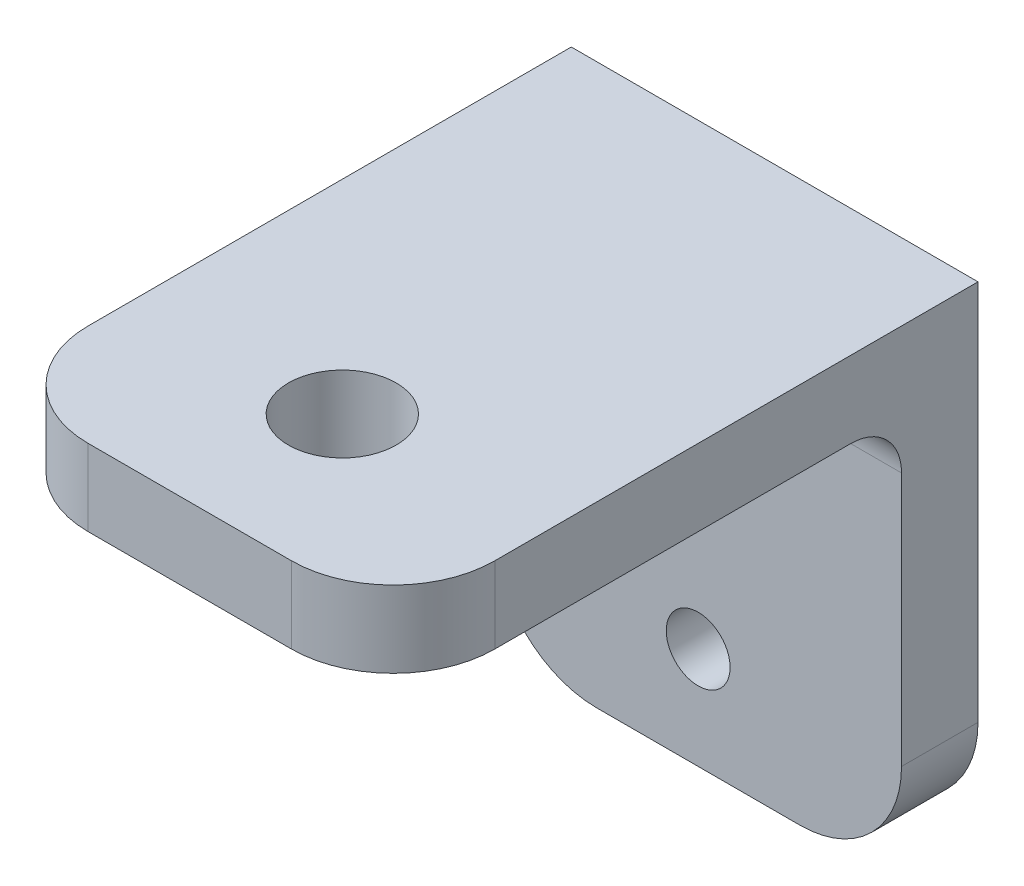
ISO-10303-21;
HEADER;
FILE_DESCRIPTION(('STEP AP214'),'2;1');
FILE_NAME('part.step','',(''),(''),'','','');
FILE_SCHEMA(('AUTOMOTIVE_DESIGN { 1 0 10303 214 1 1 1 1 }'));
ENDSEC;
DATA;
#1=APPLICATION_CONTEXT('core data for automotive mechanical design processes');
#2=APPLICATION_PROTOCOL_DEFINITION('international standard','automotive_design',2000,#1);
#3=PRODUCT_CONTEXT('',#1,'mechanical');
#4=PRODUCT('Part','Part','',(#3));
#5=PRODUCT_RELATED_PRODUCT_CATEGORY('part','',(#4));
#6=PRODUCT_DEFINITION_FORMATION('','',#4);
#7=PRODUCT_DEFINITION_CONTEXT('part definition',#1,'design');
#8=PRODUCT_DEFINITION('design','',#6,#7);
#9=PRODUCT_DEFINITION_SHAPE('','',#8);
#10=(LENGTH_UNIT() NAMED_UNIT(*) SI_UNIT(.MILLI.,.METRE.));
#11=(NAMED_UNIT(*) PLANE_ANGLE_UNIT() SI_UNIT($,.RADIAN.));
#12=(NAMED_UNIT(*) SI_UNIT($,.STERADIAN.) SOLID_ANGLE_UNIT());
#13=UNCERTAINTY_MEASURE_WITH_UNIT(LENGTH_MEASURE(1.E-05),#10,'distance_accuracy_value','');
#14=(GEOMETRIC_REPRESENTATION_CONTEXT(3) GLOBAL_UNCERTAINTY_ASSIGNED_CONTEXT((#13)) GLOBAL_UNIT_ASSIGNED_CONTEXT((#10,
#11,#12)) REPRESENTATION_CONTEXT('',''));
#15=CARTESIAN_POINT('',(0.,0.,0.));
#16=DIRECTION('',(0.,0.,1.));
#17=DIRECTION('',(1.,0.,0.));
#18=AXIS2_PLACEMENT_3D('',#15,#16,#17);
#19=CARTESIAN_POINT('',(0.,25.989203219563,79.0985735246069));
#20=DIRECTION('',(1.,0.,0.));
#21=DIRECTION('',(0.,1.,0.));
#22=AXIS2_PLACEMENT_3D('',#19,#20,#21);
#23=PLANE('',#22);
#24=DIRECTION('',(0.,0.,-1.));
#25=VECTOR('',#24,1.);
#26=CARTESIAN_POINT('',(0.,17.2516032195629,72.3548735246069));
#27=LINE('',#26,#25);
#28=CARTESIAN_POINT('',(0.,17.2516032195629,65.6111735246069));
#29=VERTEX_POINT('',#28);
#30=CARTESIAN_POINT('',(0.,17.2516032195629,60.8359735246069));
#31=VERTEX_POINT('',#30);
#32=EDGE_CURVE('E153',#29,#31,#27,.T.);
#33=ORIENTED_EDGE('',*,*,#32,.F.);
#34=DIRECTION('',(0.,-1.,0.));
#35=VECTOR('',#34,1.);
#36=CARTESIAN_POINT('',(0.,36.301603219563,65.6111735246069));
#37=LINE('',#36,#35);
#38=CARTESIAN_POINT('',(0.,33.126603219563,65.6111735246069));
#39=VERTEX_POINT('',#38);
#40=EDGE_CURVE('E271',#39,#29,#37,.T.);
#41=ORIENTED_EDGE('',*,*,#40,.F.);
#42=CARTESIAN_POINT('',(0.,33.126603219563,68.7861735246069));
#43=DIRECTION('',(-1.,0.,0.));
#44=DIRECTION('',(0.,0.707106781186546,-0.707106781186549));
#45=AXIS2_PLACEMENT_3D('',#42,#43,#44);
#46=CIRCLE('',#45,3.175);
#47=CARTESIAN_POINT('',(0.,36.301603219563,68.7861735246069));
#48=VERTEX_POINT('',#47);
#49=EDGE_CURVE('E260',#48,#39,#46,.T.);
#50=ORIENTED_EDGE('',*,*,#49,.F.);
#51=DIRECTION('',(0.,0.,-1.));
#52=VECTOR('',#51,1.);
#53=CARTESIAN_POINT('',(0.,36.301603219563,97.3611735246069));
#54=LINE('',#53,#52);
#55=CARTESIAN_POINT('',(0.,36.301603219563,91.0111735246069));
#56=VERTEX_POINT('',#55);
#57=EDGE_CURVE('E191',#56,#48,#54,.T.);
#58=ORIENTED_EDGE('',*,*,#57,.F.);
#59=DIRECTION('',(0.,-1.,0.));
#60=VECTOR('',#59,1.);
#61=CARTESIAN_POINT('',(0.,33.533003219563,91.0111735246069));
#62=LINE('',#61,#60);
#63=CARTESIAN_POINT('',(0.,41.076803219563,91.0111735246069));
#64=VERTEX_POINT('',#63);
#65=EDGE_CURVE('E257',#64,#56,#62,.T.);
#66=ORIENTED_EDGE('',*,*,#65,.F.);
#67=DIRECTION('',(0.,0.,1.));
#68=VECTOR('',#67,1.);
#69=CARTESIAN_POINT('',(0.,41.076803219563,60.8359735246069));
#70=LINE('',#69,#68);
#71=CARTESIAN_POINT('',(0.,41.076803219563,60.8359735246069));
#72=VERTEX_POINT('',#71);
#73=EDGE_CURVE('E11',#72,#64,#70,.T.);
#74=ORIENTED_EDGE('',*,*,#73,.F.);
#75=DIRECTION('',(0.,1.,0.));
#76=VECTOR('',#75,1.);
#77=CARTESIAN_POINT('',(0.,10.9016032195629,60.8359735246069));
#78=LINE('',#77,#76);
#79=EDGE_CURVE('E166',#31,#72,#78,.T.);
#80=ORIENTED_EDGE('',*,*,#79,.F.);
#81=EDGE_LOOP('',(#33,#41,#50,#58,#66,#74,#80));
#82=FACE_BOUND('',#81,.T.);
#83=ADVANCED_FACE('F17',(#82),#23,.F.);
#84=CARTESIAN_POINT('',(25.4,25.989203219563,79.0985735246069));
#85=DIRECTION('',(1.,0.,0.));
#86=DIRECTION('',(0.,1.,0.));
#87=AXIS2_PLACEMENT_3D('',#84,#85,#86);
#88=PLANE('',#87);
#89=DIRECTION('',(0.,0.,1.));
#90=VECTOR('',#89,1.);
#91=CARTESIAN_POINT('',(25.4,17.2516032195629,72.3548735246069));
#92=LINE('',#91,#90);
#93=CARTESIAN_POINT('',(25.4,17.2516032195629,60.8359735246069));
#94=VERTEX_POINT('',#93);
#95=CARTESIAN_POINT('',(25.4,17.2516032195629,65.6111735246069));
#96=VERTEX_POINT('',#95);
#97=EDGE_CURVE('E302',#94,#96,#92,.T.);
#98=ORIENTED_EDGE('',*,*,#97,.F.);
#99=DIRECTION('',(0.,1.,0.));
#100=VECTOR('',#99,1.);
#101=CARTESIAN_POINT('',(25.4,10.9016032195629,60.8359735246069));
#102=LINE('',#101,#100);
#103=CARTESIAN_POINT('',(25.4,41.076803219563,60.8359735246069));
#104=VERTEX_POINT('',#103);
#105=EDGE_CURVE('E198',#94,#104,#102,.T.);
#106=ORIENTED_EDGE('',*,*,#105,.T.);
#107=DIRECTION('',(0.,0.,1.));
#108=VECTOR('',#107,1.);
#109=CARTESIAN_POINT('',(25.4,41.076803219563,60.8359735246069));
#110=LINE('',#109,#108);
#111=CARTESIAN_POINT('',(25.4,41.076803219563,91.0111735246069));
#112=VERTEX_POINT('',#111);
#113=EDGE_CURVE('E26',#104,#112,#110,.T.);
#114=ORIENTED_EDGE('',*,*,#113,.T.);
#115=DIRECTION('',(0.,1.,0.));
#116=VECTOR('',#115,1.);
#117=CARTESIAN_POINT('',(25.4,33.533003219563,91.0111735246069));
#118=LINE('',#117,#116);
#119=CARTESIAN_POINT('',(25.4,36.301603219563,91.0111735246069));
#120=VERTEX_POINT('',#119);
#121=EDGE_CURVE('E213',#120,#112,#118,.T.);
#122=ORIENTED_EDGE('',*,*,#121,.F.);
#123=DIRECTION('',(0.,0.,-1.));
#124=VECTOR('',#123,1.);
#125=CARTESIAN_POINT('',(25.4,36.301603219563,97.3611735246069));
#126=LINE('',#125,#124);
#127=CARTESIAN_POINT('',(25.4,36.301603219563,68.7861735246069));
#128=VERTEX_POINT('',#127);
#129=EDGE_CURVE('E238',#120,#128,#126,.T.);
#130=ORIENTED_EDGE('',*,*,#129,.T.);
#131=CARTESIAN_POINT('',(25.4,33.126603219563,68.7861735246069));
#132=DIRECTION('',(1.,0.,0.));
#133=DIRECTION('',(0.,0.707106781186546,-0.707106781186549));
#134=AXIS2_PLACEMENT_3D('',#131,#132,#133);
#135=CIRCLE('',#134,3.175);
#136=CARTESIAN_POINT('',(25.4,33.126603219563,65.6111735246069));
#137=VERTEX_POINT('',#136);
#138=EDGE_CURVE('E265',#137,#128,#135,.T.);
#139=ORIENTED_EDGE('',*,*,#138,.F.);
#140=DIRECTION('',(0.,-1.,0.));
#141=VECTOR('',#140,1.);
#142=CARTESIAN_POINT('',(25.4,36.301603219563,65.6111735246069));
#143=LINE('',#142,#141);
#144=EDGE_CURVE('E268',#137,#96,#143,.T.);
#145=ORIENTED_EDGE('',*,*,#144,.T.);
#146=EDGE_LOOP('',(#98,#106,#114,#122,#130,#139,#145));
#147=FACE_BOUND('',#146,.T.);
#148=ADVANCED_FACE('F337',(#147),#88,.T.);
#149=CARTESIAN_POINT('',(0.,41.076803219563,60.8359735246069));
#150=DIRECTION('',(0.,1.,0.));
#151=DIRECTION('',(0.,0.,-1.));
#152=AXIS2_PLACEMENT_3D('',#149,#150,#151);
#153=PLANE('',#152);
#154=CARTESIAN_POINT('',(12.7,41.076803219563,87.8361735246069));
#155=DIRECTION('',(0.,-1.,0.));
#156=DIRECTION('',(1.,0.,0.));
#157=AXIS2_PLACEMENT_3D('',#154,#155,#156);
#158=CIRCLE('',#157,3.3655);
#159=CARTESIAN_POINT('',(9.3345,41.076803219563,87.8361735246069));
#160=VERTEX_POINT('',#159);
#161=EDGE_CURVE('E36',#160,#160,#158,.T.);
#162=ORIENTED_EDGE('',*,*,#161,.T.);
#163=EDGE_LOOP('',(#162));
#164=FACE_BOUND('',#163,.T.);
#165=CARTESIAN_POINT('',(19.05,41.076803219563,91.0111735246069));
#166=DIRECTION('',(0.,-1.,0.));
#167=DIRECTION('',(0.707106781186547,0.,0.707106781186548));
#168=AXIS2_PLACEMENT_3D('',#165,#166,#167);
#169=CIRCLE('',#168,6.35);
#170=CARTESIAN_POINT('',(19.05,41.076803219563,97.3611735246069));
#171=VERTEX_POINT('',#170);
#172=EDGE_CURVE('E217',#112,#171,#169,.T.);
#173=ORIENTED_EDGE('',*,*,#172,.F.);
#174=ORIENTED_EDGE('',*,*,#113,.F.);
#175=DIRECTION('',(1.,0.,0.));
#176=VECTOR('',#175,1.);
#177=CARTESIAN_POINT('',(0.,41.076803219563,60.8359735246069));
#178=LINE('',#177,#176);
#179=EDGE_CURVE('E172',#72,#104,#178,.T.);
#180=ORIENTED_EDGE('',*,*,#179,.F.);
#181=ORIENTED_EDGE('',*,*,#73,.T.);
#182=CARTESIAN_POINT('',(6.35,41.076803219563,91.0111735246069));
#183=DIRECTION('',(0.,-1.,0.));
#184=DIRECTION('',(-0.707106781186547,0.,0.707106781186548));
#185=AXIS2_PLACEMENT_3D('',#182,#183,#184);
#186=CIRCLE('',#185,6.35);
#187=CARTESIAN_POINT('',(6.35,41.076803219563,97.3611735246069));
#188=VERTEX_POINT('',#187);
#189=EDGE_CURVE('E253',#188,#64,#186,.T.);
#190=ORIENTED_EDGE('',*,*,#189,.F.);
#191=DIRECTION('',(1.,0.,0.));
#192=VECTOR('',#191,1.);
#193=CARTESIAN_POINT('',(0.,41.076803219563,97.3611735246069));
#194=LINE('',#193,#192);
#195=EDGE_CURVE('E246',#188,#171,#194,.T.);
#196=ORIENTED_EDGE('',*,*,#195,.T.);
#197=EDGE_LOOP('',(#173,#174,#180,#181,#190,#196));
#198=FACE_BOUND('',#197,.T.);
#199=ADVANCED_FACE('F346',(#164,#198),#153,.T.);
#200=CARTESIAN_POINT('',(12.7,36.301603219563,87.8361735246069));
#201=DIRECTION('',(0.,1.,0.));
#202=DIRECTION('',(1.,0.,0.));
#203=AXIS2_PLACEMENT_3D('',#200,#201,#202);
#204=CYLINDRICAL_SURFACE('',#203,3.3655);
#205=CARTESIAN_POINT('',(12.7,36.301603219563,87.8361735246069));
#206=DIRECTION('',(0.,1.,0.));
#207=DIRECTION('',(1.,0.,0.));
#208=AXIS2_PLACEMENT_3D('',#205,#206,#207);
#209=CIRCLE('',#208,3.3655);
#210=CARTESIAN_POINT('',(9.3345,36.301603219563,87.8361735246069));
#211=VERTEX_POINT('',#210);
#212=EDGE_CURVE('E242',#211,#211,#209,.T.);
#213=ORIENTED_EDGE('',*,*,#212,.F.);
#214=DIRECTION('',(0.,1.,0.));
#215=VECTOR('',#214,1.);
#216=CARTESIAN_POINT('',(9.3345,36.301603219563,87.8361735246069));
#217=LINE('',#216,#215);
#218=EDGE_CURVE('E282',#211,#160,#217,.T.);
#219=ORIENTED_EDGE('',*,*,#218,.T.);
#220=ORIENTED_EDGE('',*,*,#161,.F.);
#221=ORIENTED_EDGE('',*,*,#218,.F.);
#222=EDGE_LOOP('',(#213,#219,#220,#221));
#223=FACE_BOUND('',#222,.T.);
#224=ADVANCED_FACE('F407',(#223),#204,.F.);
#225=CARTESIAN_POINT('',(12.7,29.951603219563,65.6111735246069));
#226=DIRECTION('',(0.,0.,-1.));
#227=DIRECTION('',(1.,0.,0.));
#228=AXIS2_PLACEMENT_3D('',#225,#226,#227);
#229=CYLINDRICAL_SURFACE('',#228,1.9939);
#230=CARTESIAN_POINT('',(12.7,29.951603219563,65.6111735246069));
#231=DIRECTION('',(0.,0.,-1.));
#232=DIRECTION('',(1.,0.,0.));
#233=AXIS2_PLACEMENT_3D('',#230,#231,#232);
#234=CIRCLE('',#233,1.9939);
#235=CARTESIAN_POINT('',(10.7061,29.951603219563,65.6111735246069));
#236=VERTEX_POINT('',#235);
#237=EDGE_CURVE('E274',#236,#236,#234,.T.);
#238=ORIENTED_EDGE('',*,*,#237,.F.);
#239=DIRECTION('',(0.,0.,-1.));
#240=VECTOR('',#239,1.);
#241=CARTESIAN_POINT('',(10.7061,29.951603219563,65.6111735246069));
#242=LINE('',#241,#240);
#243=CARTESIAN_POINT('',(10.7061,29.951603219563,60.8359735246069));
#244=VERTEX_POINT('',#243);
#245=EDGE_CURVE('E229',#236,#244,#242,.T.);
#246=ORIENTED_EDGE('',*,*,#245,.T.);
#247=CARTESIAN_POINT('',(12.7,29.951603219563,60.8359735246069));
#248=DIRECTION('',(0.,0.,1.));
#249=DIRECTION('',(1.,0.,0.));
#250=AXIS2_PLACEMENT_3D('',#247,#248,#249);
#251=CIRCLE('',#250,1.9939);
#252=EDGE_CURVE('E197',#244,#244,#251,.T.);
#253=ORIENTED_EDGE('',*,*,#252,.F.);
#254=ORIENTED_EDGE('',*,*,#245,.F.);
#255=EDGE_LOOP('',(#238,#246,#253,#254));
#256=FACE_BOUND('',#255,.T.);
#257=ADVANCED_FACE('F384',(#256),#229,.F.);
#258=CARTESIAN_POINT('',(12.7,17.2516032195629,65.6111735246069));
#259=DIRECTION('',(0.,0.,-1.));
#260=DIRECTION('',(1.,0.,0.));
#261=AXIS2_PLACEMENT_3D('',#258,#259,#260);
#262=CYLINDRICAL_SURFACE('',#261,1.9939);
#263=CARTESIAN_POINT('',(12.7,17.2516032195629,65.6111735246069));
#264=DIRECTION('',(0.,0.,-1.));
#265=DIRECTION('',(1.,0.,0.));
#266=AXIS2_PLACEMENT_3D('',#263,#264,#265);
#267=CIRCLE('',#266,1.9939);
#268=CARTESIAN_POINT('',(10.7061,17.2516032195629,65.6111735246069));
#269=VERTEX_POINT('',#268);
#270=EDGE_CURVE('E230',#269,#269,#267,.T.);
#271=ORIENTED_EDGE('',*,*,#270,.F.);
#272=DIRECTION('',(0.,0.,-1.));
#273=VECTOR('',#272,1.);
#274=CARTESIAN_POINT('',(10.7061,17.2516032195629,65.6111735246069));
#275=LINE('',#274,#273);
#276=CARTESIAN_POINT('',(10.7061,17.2516032195629,60.8359735246069));
#277=VERTEX_POINT('',#276);
#278=EDGE_CURVE('E45',#269,#277,#275,.T.);
#279=ORIENTED_EDGE('',*,*,#278,.T.);
#280=CARTESIAN_POINT('',(12.7,17.2516032195629,60.8359735246069));
#281=DIRECTION('',(0.,0.,1.));
#282=DIRECTION('',(1.,0.,0.));
#283=AXIS2_PLACEMENT_3D('',#280,#281,#282);
#284=CIRCLE('',#283,1.9939);
#285=EDGE_CURVE('E193',#277,#277,#284,.T.);
#286=ORIENTED_EDGE('',*,*,#285,.F.);
#287=ORIENTED_EDGE('',*,*,#278,.F.);
#288=EDGE_LOOP('',(#271,#279,#286,#287));
#289=FACE_BOUND('',#288,.T.);
#290=ADVANCED_FACE('F378',(#289),#262,.F.);
#291=CARTESIAN_POINT('',(0.,36.301603219563,65.6111735246069));
#292=DIRECTION('',(0.,0.,1.));
#293=DIRECTION('',(1.,0.,0.));
#294=AXIS2_PLACEMENT_3D('',#291,#292,#293);
#295=PLANE('',#294);
#296=ORIENTED_EDGE('',*,*,#270,.T.);
#297=EDGE_LOOP('',(#296));
#298=FACE_BOUND('',#297,.T.);
#299=ORIENTED_EDGE('',*,*,#237,.T.);
#300=EDGE_LOOP('',(#299));
#301=FACE_BOUND('',#300,.T.);
#302=CARTESIAN_POINT('',(19.05,17.2516032195629,65.6111735246069));
#303=DIRECTION('',(0.,0.,-1.));
#304=DIRECTION('',(0.707106781186548,-0.707106781186548,0.));
#305=AXIS2_PLACEMENT_3D('',#302,#303,#304);
#306=CIRCLE('',#305,6.35);
#307=CARTESIAN_POINT('',(19.05,10.9016032195629,65.6111735246069));
#308=VERTEX_POINT('',#307);
#309=EDGE_CURVE('E298',#96,#308,#306,.T.);
#310=ORIENTED_EDGE('',*,*,#309,.F.);
#311=ORIENTED_EDGE('',*,*,#144,.F.);
#312=DIRECTION('',(1.,0.,0.));
#313=VECTOR('',#312,1.);
#314=CARTESIAN_POINT('',(0.,33.126603219563,65.6111735246069));
#315=LINE('',#314,#313);
#316=EDGE_CURVE('E261',#39,#137,#315,.T.);
#317=ORIENTED_EDGE('',*,*,#316,.F.);
#318=ORIENTED_EDGE('',*,*,#40,.T.);
#319=CARTESIAN_POINT('',(6.35,17.2516032195629,65.6111735246069));
#320=DIRECTION('',(0.,0.,-1.));
#321=DIRECTION('',(-0.707106781186547,-0.707106781186548,0.));
#322=AXIS2_PLACEMENT_3D('',#319,#320,#321);
#323=CIRCLE('',#322,6.35);
#324=CARTESIAN_POINT('',(6.35,10.9016032195629,65.6111735246069));
#325=VERTEX_POINT('',#324);
#326=EDGE_CURVE('E160',#325,#29,#323,.T.);
#327=ORIENTED_EDGE('',*,*,#326,.F.);
#328=DIRECTION('',(1.,0.,0.));
#329=VECTOR('',#328,1.);
#330=CARTESIAN_POINT('',(0.,10.9016032195629,65.6111735246069));
#331=LINE('',#330,#329);
#332=EDGE_CURVE('E202',#325,#308,#331,.T.);
#333=ORIENTED_EDGE('',*,*,#332,.T.);
#334=EDGE_LOOP('',(#310,#311,#317,#318,#327,#333));
#335=FACE_BOUND('',#334,.T.);
#336=ADVANCED_FACE('F19',(#298,#301,#335),#295,.T.);
#337=CARTESIAN_POINT('',(0.,33.126603219563,68.7861735246069));
#338=DIRECTION('',(1.,0.,0.));
#339=DIRECTION('',(0.,0.707106781186546,-0.707106781186549));
#340=AXIS2_PLACEMENT_3D('',#337,#338,#339);
#341=CYLINDRICAL_SURFACE('',#340,3.175);
#342=ORIENTED_EDGE('',*,*,#49,.T.);
#343=ORIENTED_EDGE('',*,*,#316,.T.);
#344=ORIENTED_EDGE('',*,*,#138,.T.);
#345=DIRECTION('',(-1.,0.,0.));
#346=VECTOR('',#345,1.);
#347=CARTESIAN_POINT('',(0.,36.301603219563,68.7861735246069));
#348=LINE('',#347,#346);
#349=EDGE_CURVE('E234',#128,#48,#348,.T.);
#350=ORIENTED_EDGE('',*,*,#349,.T.);
#351=EDGE_LOOP('',(#342,#343,#344,#350));
#352=FACE_BOUND('',#351,.T.);
#353=ADVANCED_FACE('F330',(#352),#341,.F.);
#354=CARTESIAN_POINT('',(6.35,33.533003219563,91.0111735246069));
#355=DIRECTION('',(0.,-1.,0.));
#356=DIRECTION('',(-0.707106781186547,0.,0.707106781186548));
#357=AXIS2_PLACEMENT_3D('',#354,#355,#356);
#358=CYLINDRICAL_SURFACE('',#357,6.35);
#359=CARTESIAN_POINT('',(6.35,36.301603219563,91.0111735246069));
#360=DIRECTION('',(0.,1.,0.));
#361=DIRECTION('',(-0.707106781186547,0.,0.707106781186548));
#362=AXIS2_PLACEMENT_3D('',#359,#360,#361);
#363=CIRCLE('',#362,6.35);
#364=CARTESIAN_POINT('',(6.35,36.301603219563,97.3611735246069));
#365=VERTEX_POINT('',#364);
#366=EDGE_CURVE('E187',#56,#365,#363,.T.);
#367=ORIENTED_EDGE('',*,*,#366,.T.);
#368=DIRECTION('',(0.,1.,0.));
#369=VECTOR('',#368,1.);
#370=CARTESIAN_POINT('',(6.35,33.533003219563,97.3611735246069));
#371=LINE('',#370,#369);
#372=EDGE_CURVE('E249',#365,#188,#371,.T.);
#373=ORIENTED_EDGE('',*,*,#372,.T.);
#374=ORIENTED_EDGE('',*,*,#189,.T.);
#375=ORIENTED_EDGE('',*,*,#65,.T.);
#376=EDGE_LOOP('',(#367,#373,#374,#375));
#377=FACE_BOUND('',#376,.T.);
#378=ADVANCED_FACE('F343',(#377),#358,.T.);
#379=CARTESIAN_POINT('',(0.,41.076803219563,97.3611735246069));
#380=DIRECTION('',(0.,0.,1.));
#381=DIRECTION('',(1.,0.,0.));
#382=AXIS2_PLACEMENT_3D('',#379,#380,#381);
#383=PLANE('',#382);
#384=DIRECTION('',(0.,-1.,0.));
#385=VECTOR('',#384,1.);
#386=CARTESIAN_POINT('',(19.05,33.533003219563,97.3611735246069));
#387=LINE('',#386,#385);
#388=CARTESIAN_POINT('',(19.05,36.301603219563,97.3611735246069));
#389=VERTEX_POINT('',#388);
#390=EDGE_CURVE('E221',#171,#389,#387,.T.);
#391=ORIENTED_EDGE('',*,*,#390,.F.);
#392=ORIENTED_EDGE('',*,*,#195,.F.);
#393=ORIENTED_EDGE('',*,*,#372,.F.);
#394=DIRECTION('',(1.,0.,0.));
#395=VECTOR('',#394,1.);
#396=CARTESIAN_POINT('',(0.,36.301603219563,97.3611735246069));
#397=LINE('',#396,#395);
#398=EDGE_CURVE('E192',#365,#389,#397,.T.);
#399=ORIENTED_EDGE('',*,*,#398,.T.);
#400=EDGE_LOOP('',(#391,#392,#393,#399));
#401=FACE_BOUND('',#400,.T.);
#402=ADVANCED_FACE('F351',(#401),#383,.T.);
#403=CARTESIAN_POINT('',(0.,36.301603219563,97.3611735246069));
#404=DIRECTION('',(0.,-1.,0.));
#405=DIRECTION('',(0.,0.,-1.));
#406=AXIS2_PLACEMENT_3D('',#403,#404,#405);
#407=PLANE('',#406);
#408=ORIENTED_EDGE('',*,*,#212,.T.);
#409=EDGE_LOOP('',(#408));
#410=FACE_BOUND('',#409,.T.);
#411=CARTESIAN_POINT('',(19.05,36.301603219563,91.0111735246069));
#412=DIRECTION('',(0.,1.,0.));
#413=DIRECTION('',(0.707106781186547,0.,0.707106781186548));
#414=AXIS2_PLACEMENT_3D('',#411,#412,#413);
#415=CIRCLE('',#414,6.35);
#416=EDGE_CURVE('E163',#389,#120,#415,.T.);
#417=ORIENTED_EDGE('',*,*,#416,.F.);
#418=ORIENTED_EDGE('',*,*,#398,.F.);
#419=ORIENTED_EDGE('',*,*,#366,.F.);
#420=ORIENTED_EDGE('',*,*,#57,.T.);
#421=ORIENTED_EDGE('',*,*,#349,.F.);
#422=ORIENTED_EDGE('',*,*,#129,.F.);
#423=EDGE_LOOP('',(#417,#418,#419,#420,#421,#422));
#424=FACE_BOUND('',#423,.T.);
#425=ADVANCED_FACE('F340',(#410,#424),#407,.T.);
#426=CARTESIAN_POINT('',(19.05,33.533003219563,91.0111735246069));
#427=DIRECTION('',(0.,-1.,0.));
#428=DIRECTION('',(0.707106781186547,0.,0.707106781186548));
#429=AXIS2_PLACEMENT_3D('',#426,#427,#428);
#430=CYLINDRICAL_SURFACE('',#429,6.35);
#431=ORIENTED_EDGE('',*,*,#416,.T.);
#432=ORIENTED_EDGE('',*,*,#121,.T.);
#433=ORIENTED_EDGE('',*,*,#172,.T.);
#434=ORIENTED_EDGE('',*,*,#390,.T.);
#435=EDGE_LOOP('',(#431,#432,#433,#434));
#436=FACE_BOUND('',#435,.T.);
#437=ADVANCED_FACE('F349',(#436),#430,.T.);
#438=CARTESIAN_POINT('',(6.35,17.2516032195629,72.3548735246069));
#439=DIRECTION('',(0.,0.,-1.));
#440=DIRECTION('',(-0.707106781186547,-0.707106781186548,0.));
#441=AXIS2_PLACEMENT_3D('',#438,#439,#440);
#442=CYLINDRICAL_SURFACE('',#441,6.35);
#443=CARTESIAN_POINT('',(6.35,17.2516032195629,60.8359735246069));
#444=DIRECTION('',(0.,0.,1.));
#445=DIRECTION('',(-0.707106781186547,-0.707106781186548,0.));
#446=AXIS2_PLACEMENT_3D('',#443,#444,#445);
#447=CIRCLE('',#446,6.35);
#448=CARTESIAN_POINT('',(6.35,10.9016032195629,60.8359735246069));
#449=VERTEX_POINT('',#448);
#450=EDGE_CURVE('E158',#31,#449,#447,.T.);
#451=ORIENTED_EDGE('',*,*,#450,.T.);
#452=DIRECTION('',(0.,0.,1.));
#453=VECTOR('',#452,1.);
#454=CARTESIAN_POINT('',(6.35,10.9016032195629,72.3548735246069));
#455=LINE('',#454,#453);
#456=EDGE_CURVE('E207',#449,#325,#455,.T.);
#457=ORIENTED_EDGE('',*,*,#456,.T.);
#458=ORIENTED_EDGE('',*,*,#326,.T.);
#459=ORIENTED_EDGE('',*,*,#32,.T.);
#460=EDGE_LOOP('',(#451,#457,#458,#459));
#461=FACE_BOUND('',#460,.T.);
#462=ADVANCED_FACE('F155',(#461),#442,.T.);
#463=CARTESIAN_POINT('',(0.,10.9016032195629,65.6111735246069));
#464=DIRECTION('',(0.,-1.,0.));
#465=DIRECTION('',(0.,0.,-1.));
#466=AXIS2_PLACEMENT_3D('',#463,#464,#465);
#467=PLANE('',#466);
#468=DIRECTION('',(0.,0.,-1.));
#469=VECTOR('',#468,1.);
#470=CARTESIAN_POINT('',(19.05,10.9016032195629,72.3548735246069));
#471=LINE('',#470,#469);
#472=CARTESIAN_POINT('',(19.05,10.9016032195629,60.8359735246069));
#473=VERTEX_POINT('',#472);
#474=EDGE_CURVE('E183',#308,#473,#471,.T.);
#475=ORIENTED_EDGE('',*,*,#474,.F.);
#476=ORIENTED_EDGE('',*,*,#332,.F.);
#477=ORIENTED_EDGE('',*,*,#456,.F.);
#478=DIRECTION('',(1.,0.,0.));
#479=VECTOR('',#478,1.);
#480=CARTESIAN_POINT('',(0.,10.9016032195629,60.8359735246069));
#481=LINE('',#480,#479);
#482=EDGE_CURVE('E176',#449,#473,#481,.T.);
#483=ORIENTED_EDGE('',*,*,#482,.T.);
#484=EDGE_LOOP('',(#475,#476,#477,#483));
#485=FACE_BOUND('',#484,.T.);
#486=ADVANCED_FACE('F393',(#485),#467,.T.);
#487=CARTESIAN_POINT('',(0.,10.9016032195629,60.8359735246069));
#488=DIRECTION('',(0.,0.,-1.));
#489=DIRECTION('',(-1.,0.,0.));
#490=AXIS2_PLACEMENT_3D('',#487,#488,#489);
#491=PLANE('',#490);
#492=ORIENTED_EDGE('',*,*,#252,.T.);
#493=EDGE_LOOP('',(#492));
#494=FACE_BOUND('',#493,.T.);
#495=ORIENTED_EDGE('',*,*,#285,.T.);
#496=EDGE_LOOP('',(#495));
#497=FACE_BOUND('',#496,.T.);
#498=CARTESIAN_POINT('',(19.05,17.2516032195629,60.8359735246069));
#499=DIRECTION('',(0.,0.,1.));
#500=DIRECTION('',(0.707106781186548,-0.707106781186548,0.));
#501=AXIS2_PLACEMENT_3D('',#498,#499,#500);
#502=CIRCLE('',#501,6.35);
#503=EDGE_CURVE('E313',#473,#94,#502,.T.);
#504=ORIENTED_EDGE('',*,*,#503,.F.);
#505=ORIENTED_EDGE('',*,*,#482,.F.);
#506=ORIENTED_EDGE('',*,*,#450,.F.);
#507=ORIENTED_EDGE('',*,*,#79,.T.);
#508=ORIENTED_EDGE('',*,*,#179,.T.);
#509=ORIENTED_EDGE('',*,*,#105,.F.);
#510=EDGE_LOOP('',(#504,#505,#506,#507,#508,#509));
#511=FACE_BOUND('',#510,.T.);
#512=ADVANCED_FACE('F175',(#494,#497,#511),#491,.T.);
#513=CARTESIAN_POINT('',(19.05,17.2516032195629,72.3548735246069));
#514=DIRECTION('',(0.,0.,-1.));
#515=DIRECTION('',(0.707106781186548,-0.707106781186548,0.));
#516=AXIS2_PLACEMENT_3D('',#513,#514,#515);
#517=CYLINDRICAL_SURFACE('',#516,6.35);
#518=ORIENTED_EDGE('',*,*,#503,.T.);
#519=ORIENTED_EDGE('',*,*,#97,.T.);
#520=ORIENTED_EDGE('',*,*,#309,.T.);
#521=ORIENTED_EDGE('',*,*,#474,.T.);
#522=EDGE_LOOP('',(#518,#519,#520,#521));
#523=FACE_BOUND('',#522,.T.);
#524=ADVANCED_FACE('F311',(#523),#517,.T.);
#525=CLOSED_SHELL('',(#83,#148,#199,#224,#257,#290,#336,#353,#378,#402,#425,#437,#462,#486,#512,#524));
#526=MANIFOLD_SOLID_BREP('B1',#525);
#527=ADVANCED_BREP_SHAPE_REPRESENTATION('',(#18,#526),#14);
#528=SHAPE_DEFINITION_REPRESENTATION(#9,#527);
ENDSEC;
END-ISO-10303-21;
